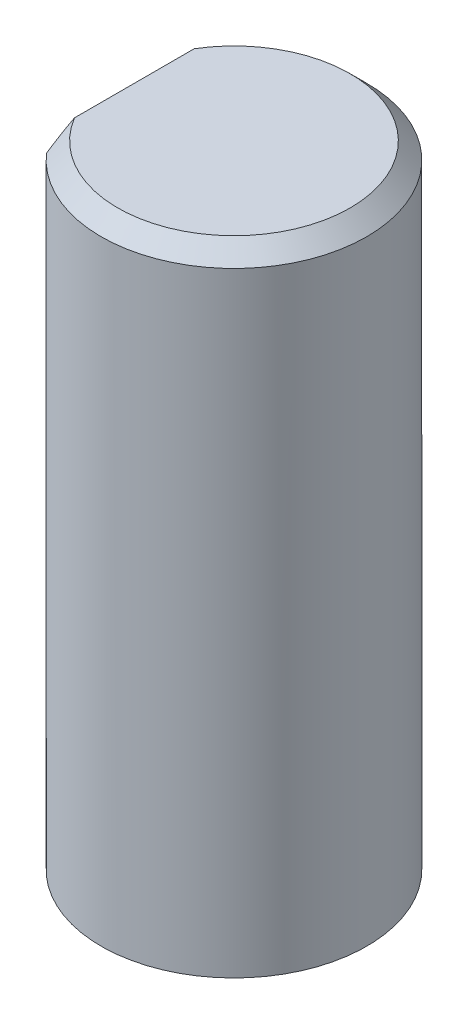
ISO-10303-21;
HEADER;
FILE_DESCRIPTION(('STEP AP214'),'2;1');
FILE_NAME('part.step','',(''),(''),'','','');
FILE_SCHEMA(('AUTOMOTIVE_DESIGN { 1 0 10303 214 1 1 1 1 }'));
ENDSEC;
DATA;
#1=APPLICATION_CONTEXT('core data for automotive mechanical design processes');
#2=APPLICATION_PROTOCOL_DEFINITION('international standard','automotive_design',2000,#1);
#3=PRODUCT_CONTEXT('',#1,'mechanical');
#4=PRODUCT('Part','Part','',(#3));
#5=PRODUCT_RELATED_PRODUCT_CATEGORY('part','',(#4));
#6=PRODUCT_DEFINITION_FORMATION('','',#4);
#7=PRODUCT_DEFINITION_CONTEXT('part definition',#1,'design');
#8=PRODUCT_DEFINITION('design','',#6,#7);
#9=PRODUCT_DEFINITION_SHAPE('','',#8);
#10=(LENGTH_UNIT() NAMED_UNIT(*) SI_UNIT(.MILLI.,.METRE.));
#11=(NAMED_UNIT(*) PLANE_ANGLE_UNIT() SI_UNIT($,.RADIAN.));
#12=(NAMED_UNIT(*) SI_UNIT($,.STERADIAN.) SOLID_ANGLE_UNIT());
#13=UNCERTAINTY_MEASURE_WITH_UNIT(LENGTH_MEASURE(1.E-05),#10,'distance_accuracy_value','');
#14=(GEOMETRIC_REPRESENTATION_CONTEXT(3) GLOBAL_UNCERTAINTY_ASSIGNED_CONTEXT((#13)) GLOBAL_UNIT_ASSIGNED_CONTEXT((#10,
#11,#12)) REPRESENTATION_CONTEXT('',''));
#15=CARTESIAN_POINT('',(0.,0.,0.));
#16=DIRECTION('',(0.,0.,1.));
#17=DIRECTION('',(1.,0.,0.));
#18=AXIS2_PLACEMENT_3D('',#15,#16,#17);
#19=CARTESIAN_POINT('',(0.,77.5,0.));
#20=DIRECTION('',(0.,1.,0.));
#21=DIRECTION('',(1.,0.,0.));
#22=AXIS2_PLACEMENT_3D('',#19,#20,#21);
#23=PLANE('',#22);
#24=CARTESIAN_POINT('',(0.,77.5,0.));
#25=DIRECTION('',(0.,1.,0.));
#26=DIRECTION('',(1.,0.,0.));
#27=AXIS2_PLACEMENT_3D('',#24,#25,#26);
#28=CIRCLE('',#27,4.);
#29=CARTESIAN_POINT('',(-4.00000000000007,77.5,0.));
#30=VERTEX_POINT('',#29);
#31=EDGE_CURVE('E11',#30,#30,#28,.T.);
#32=ORIENTED_EDGE('',*,*,#31,.F.);
#33=EDGE_LOOP('',(#32));
#34=FACE_BOUND('',#33,.T.);
#35=ADVANCED_FACE('F16',(#34),#23,.F.);
#36=CARTESIAN_POINT('',(0.,77.5,0.));
#37=DIRECTION('',(0.,1.,0.));
#38=DIRECTION('',(1.,0.,0.));
#39=AXIS2_PLACEMENT_3D('',#36,#37,#38);
#40=CYLINDRICAL_SURFACE('',#39,4.);
#41=CARTESIAN_POINT('',(0.,96.,0.));
#42=DIRECTION('',(0.,1.,0.));
#43=DIRECTION('',(1.,0.,0.));
#44=AXIS2_PLACEMENT_3D('',#41,#42,#43);
#45=CIRCLE('',#44,4.);
#46=CARTESIAN_POINT('',(-3.00000000000007,96.,2.64575131106459));
#47=VERTEX_POINT('',#46);
#48=CARTESIAN_POINT('',(-3.00000000000007,96.,-2.64575131106459));
#49=VERTEX_POINT('',#48);
#50=EDGE_CURVE('E76',#47,#49,#45,.T.);
#51=ORIENTED_EDGE('',*,*,#50,.F.);
#52=DIRECTION('',(0.,-1.,0.));
#53=VECTOR('',#52,1.);
#54=CARTESIAN_POINT('',(-3.00000000000007,77.5,2.64575131106459));
#55=LINE('',#54,#53);
#56=CARTESIAN_POINT('',(-3.00000000000007,82.5,2.64575131106459));
#57=VERTEX_POINT('',#56);
#58=EDGE_CURVE('E20',#47,#57,#55,.T.);
#59=ORIENTED_EDGE('',*,*,#58,.T.);
#60=CARTESIAN_POINT('',(0.,85.5,0.));
#61=DIRECTION('',(0.707106781186552,-0.707106781186543,0.));
#62=DIRECTION('',(0.707106781186543,0.707106781186552,0.));
#63=AXIS2_PLACEMENT_3D('',#60,#61,#62);
#64=ELLIPSE('',#63,5.65685424949242,4.);
#65=CARTESIAN_POINT('',(-4.00000000000007,81.5,0.));
#66=VERTEX_POINT('',#65);
#67=EDGE_CURVE('E101',#57,#66,#64,.T.);
#68=ORIENTED_EDGE('',*,*,#67,.T.);
#69=DIRECTION('',(0.,-1.,0.));
#70=VECTOR('',#69,1.);
#71=CARTESIAN_POINT('',(-4.00000000000007,77.5,0.));
#72=LINE('',#71,#70);
#73=EDGE_CURVE('E27',#66,#30,#72,.T.);
#74=ORIENTED_EDGE('',*,*,#73,.T.);
#75=ORIENTED_EDGE('',*,*,#31,.T.);
#76=ORIENTED_EDGE('',*,*,#73,.F.);
#77=CARTESIAN_POINT('',(0.,85.5,0.));
#78=DIRECTION('',(0.707106781186552,-0.707106781186543,0.));
#79=DIRECTION('',(0.707106781186543,0.707106781186552,0.));
#80=AXIS2_PLACEMENT_3D('',#77,#78,#79);
#81=ELLIPSE('',#80,5.65685424949242,4.);
#82=CARTESIAN_POINT('',(-3.00000000000007,82.5,-2.64575131106459));
#83=VERTEX_POINT('',#82);
#84=EDGE_CURVE('E96',#66,#83,#81,.T.);
#85=ORIENTED_EDGE('',*,*,#84,.T.);
#86=DIRECTION('',(0.,1.,0.));
#87=VECTOR('',#86,1.);
#88=CARTESIAN_POINT('',(-3.00000000000007,77.5,-2.64575131106459));
#89=LINE('',#88,#87);
#90=EDGE_CURVE('E75',#83,#49,#89,.T.);
#91=ORIENTED_EDGE('',*,*,#90,.T.);
#92=EDGE_LOOP('',(#51,#59,#68,#74,#75,#76,#85,#91));
#93=FACE_BOUND('',#92,.T.);
#94=ADVANCED_FACE('F18',(#93),#40,.T.);
#95=CARTESIAN_POINT('',(-4.00000000000007,81.5,0.));
#96=DIRECTION('',(0.707106781186552,-0.707106781186543,0.));
#97=DIRECTION('',(0.,0.,-1.));
#98=AXIS2_PLACEMENT_3D('',#95,#96,#97);
#99=PLANE('',#98);
#100=ORIENTED_EDGE('',*,*,#67,.F.);
#101=DIRECTION('',(0.,0.,1.));
#102=VECTOR('',#101,1.);
#103=CARTESIAN_POINT('',(-3.00000000000007,82.5,0.));
#104=LINE('',#103,#102);
#105=EDGE_CURVE('E105',#83,#57,#104,.T.);
#106=ORIENTED_EDGE('',*,*,#105,.F.);
#107=ORIENTED_EDGE('',*,*,#84,.F.);
#108=EDGE_LOOP('',(#100,#106,#107));
#109=FACE_BOUND('',#108,.T.);
#110=ADVANCED_FACE('F179',(#109),#99,.F.);
#111=CARTESIAN_POINT('',(-3.00000000000007,82.5,0.));
#112=DIRECTION('',(1.,0.,0.));
#113=DIRECTION('',(0.,1.,0.));
#114=AXIS2_PLACEMENT_3D('',#111,#112,#113);
#115=PLANE('',#114);
#116=CARTESIAN_POINT('',(-3.00000000000007,96.5,1.80277563773196));
#117=CARTESIAN_POINT('',(-3.00000000000007,96.2973738657208,2.19616428528861));
#118=CARTESIAN_POINT('',(-3.00000000000007,95.9999999999999,2.64575131106459));
#119=(BOUNDED_CURVE() B_SPLINE_CURVE(2,(#116,#117,#118),.UNSPECIFIED.,.F.,
.F.) B_SPLINE_CURVE_WITH_KNOTS((3,3),(0.,0.227446100525383),
.UNSPECIFIED.) CURVE() GEOMETRIC_REPRESENTATION_ITEM() RATIONAL_B_SPLINE_CURVE((1.,
1.05179579701085,1.09229879999338)) REPRESENTATION_ITEM(''));
#120=CARTESIAN_POINT('',(-3.00000000000007,96.5,1.802775637732));
#121=VERTEX_POINT('',#120);
#122=EDGE_CURVE('E71',#121,#47,#119,.T.);
#123=ORIENTED_EDGE('',*,*,#122,.F.);
#124=DIRECTION('',(0.,0.,1.));
#125=VECTOR('',#124,1.);
#126=CARTESIAN_POINT('',(-3.00000000000007,96.5,0.));
#127=LINE('',#126,#125);
#128=CARTESIAN_POINT('',(-3.00000000000007,96.5,-1.802775637732));
#129=VERTEX_POINT('',#128);
#130=EDGE_CURVE('E63',#129,#121,#127,.T.);
#131=ORIENTED_EDGE('',*,*,#130,.F.);
#132=CARTESIAN_POINT('',(-3.00000000000007,95.9999999999999,-2.64575131106459));
#133=CARTESIAN_POINT('',(-3.00000000000007,96.297373865721,-2.19616428528861));
#134=CARTESIAN_POINT('',(-3.00000000000007,96.5,-1.80277563773196));
#135=(BOUNDED_CURVE() B_SPLINE_CURVE(2,(#132,#133,#134),.UNSPECIFIED.,.F.,
.F.) B_SPLINE_CURVE_WITH_KNOTS((3,3),(1.85897326109122,2.0864193616166),
.UNSPECIFIED.) CURVE() GEOMETRIC_REPRESENTATION_ITEM() RATIONAL_B_SPLINE_CURVE((1.09229879999338,
1.05179579701085,1.)) REPRESENTATION_ITEM(''));
#136=EDGE_CURVE('E68',#49,#129,#135,.T.);
#137=ORIENTED_EDGE('',*,*,#136,.F.);
#138=ORIENTED_EDGE('',*,*,#90,.F.);
#139=ORIENTED_EDGE('',*,*,#105,.T.);
#140=ORIENTED_EDGE('',*,*,#58,.F.);
#141=EDGE_LOOP('',(#123,#131,#137,#138,#139,#140));
#142=FACE_BOUND('',#141,.T.);
#143=ADVANCED_FACE('F65',(#142),#115,.F.);
#144=CARTESIAN_POINT('',(0.,96.5,0.));
#145=DIRECTION('',(0.,1.,0.));
#146=DIRECTION('',(1.,0.,0.));
#147=AXIS2_PLACEMENT_3D('',#144,#145,#146);
#148=PLANE('',#147);
#149=CARTESIAN_POINT('',(0.,96.5,0.));
#150=DIRECTION('',(0.,-1.,0.));
#151=DIRECTION('',(1.,0.,0.));
#152=AXIS2_PLACEMENT_3D('',#149,#150,#151);
#153=CIRCLE('',#152,3.5);
#154=EDGE_CURVE('E78',#129,#121,#153,.T.);
#155=ORIENTED_EDGE('',*,*,#154,.F.);
#156=ORIENTED_EDGE('',*,*,#130,.T.);
#157=EDGE_LOOP('',(#155,#156));
#158=FACE_BOUND('',#157,.T.);
#159=ADVANCED_FACE('F79',(#158),#148,.T.);
#160=CARTESIAN_POINT('',(0.,96.25,0.));
#161=DIRECTION('',(0.,-1.,0.));
#162=DIRECTION('',(1.,0.,0.));
#163=AXIS2_PLACEMENT_3D('',#160,#161,#162);
#164=CONICAL_SURFACE('',#163,3.75,0.785398163397441);
#165=ORIENTED_EDGE('',*,*,#136,.T.);
#166=ORIENTED_EDGE('',*,*,#154,.T.);
#167=ORIENTED_EDGE('',*,*,#122,.T.);
#168=ORIENTED_EDGE('',*,*,#50,.T.);
#169=EDGE_LOOP('',(#165,#166,#167,#168));
#170=FACE_BOUND('',#169,.T.);
#171=ADVANCED_FACE('F84',(#170),#164,.T.);
#172=CLOSED_SHELL('',(#35,#94,#110,#143,#159,#171));
#173=MANIFOLD_SOLID_BREP('B1',#172);
#174=ADVANCED_BREP_SHAPE_REPRESENTATION('',(#18,#173),#14);
#175=SHAPE_DEFINITION_REPRESENTATION(#9,#174);
ENDSEC;
END-ISO-10303-21;
